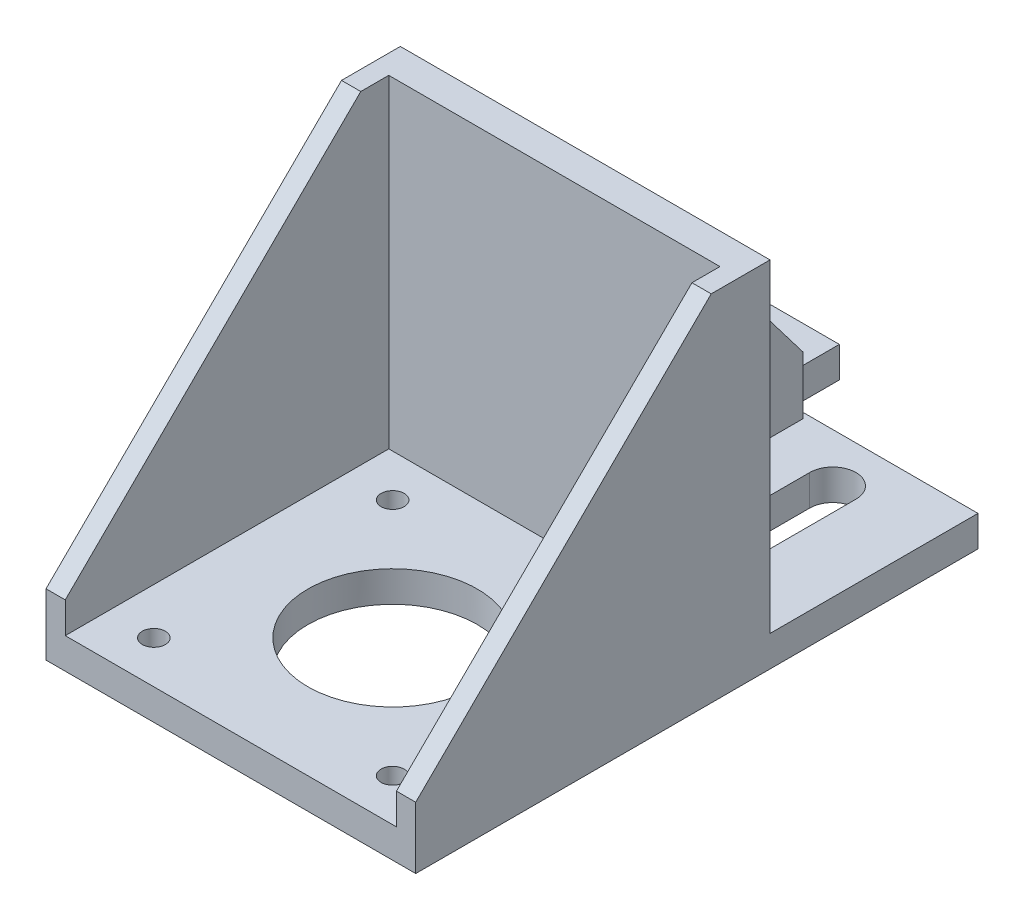
ISO-10303-21;
HEADER;
FILE_DESCRIPTION(('STEP AP214'),'2;1');
FILE_NAME('part.step','',(''),(''),'','','');
FILE_SCHEMA(('AUTOMOTIVE_DESIGN { 1 0 10303 214 1 1 1 1 }'));
ENDSEC;
DATA;
#1=APPLICATION_CONTEXT('core data for automotive mechanical design processes');
#2=APPLICATION_PROTOCOL_DEFINITION('international standard','automotive_design',2000,#1);
#3=PRODUCT_CONTEXT('',#1,'mechanical');
#4=PRODUCT('Part','Part','',(#3));
#5=PRODUCT_RELATED_PRODUCT_CATEGORY('part','',(#4));
#6=PRODUCT_DEFINITION_FORMATION('','',#4);
#7=PRODUCT_DEFINITION_CONTEXT('part definition',#1,'design');
#8=PRODUCT_DEFINITION('design','',#6,#7);
#9=PRODUCT_DEFINITION_SHAPE('','',#8);
#10=(LENGTH_UNIT() NAMED_UNIT(*) SI_UNIT(.MILLI.,.METRE.));
#11=(NAMED_UNIT(*) PLANE_ANGLE_UNIT() SI_UNIT($,.RADIAN.));
#12=(NAMED_UNIT(*) SI_UNIT($,.STERADIAN.) SOLID_ANGLE_UNIT());
#13=UNCERTAINTY_MEASURE_WITH_UNIT(LENGTH_MEASURE(1.E-05),#10,'distance_accuracy_value','');
#14=(GEOMETRIC_REPRESENTATION_CONTEXT(3) GLOBAL_UNCERTAINTY_ASSIGNED_CONTEXT((#13)) GLOBAL_UNIT_ASSIGNED_CONTEXT((#10,
#11,#12)) REPRESENTATION_CONTEXT('',''));
#15=CARTESIAN_POINT('',(0.,0.,0.));
#16=DIRECTION('',(0.,0.,1.));
#17=DIRECTION('',(1.,0.,0.));
#18=AXIS2_PLACEMENT_3D('',#15,#16,#17);
#19=CARTESIAN_POINT('',(-23.,24.7347576580942,-35.1537503302098));
#20=DIRECTION('',(0.,-0.606022226007594,0.795447711408362));
#21=DIRECTION('',(-1.,0.,0.));
#22=AXIS2_PLACEMENT_3D('',#19,#20,#21);
#23=PLANE('',#22);
#24=DIRECTION('',(0.,0.795447711408362,0.606022226007594));
#25=VECTOR('',#24,1.);
#26=CARTESIAN_POINT('',(-2.,35.6603818391844,-26.8299208794672));
#27=LINE('',#26,#25);
#28=CARTESIAN_POINT('',(-2.,7.46951531618834,-48.3075006604195));
#29=VERTEX_POINT('',#28);
#30=CARTESIAN_POINT('',(-2.,42.,-22.));
#31=VERTEX_POINT('',#30);
#32=EDGE_CURVE('E10',#29,#31,#27,.T.);
#33=ORIENTED_EDGE('',*,*,#32,.T.);
#34=DIRECTION('',(1.,0.,0.));
#35=VECTOR('',#34,1.);
#36=CARTESIAN_POINT('',(-23.,42.,-22.));
#37=LINE('',#36,#35);
#38=CARTESIAN_POINT('',(2.,42.,-22.));
#39=VERTEX_POINT('',#38);
#40=EDGE_CURVE('E292',#31,#39,#37,.T.);
#41=ORIENTED_EDGE('',*,*,#40,.T.);
#42=DIRECTION('',(0.,-0.795447711408362,-0.606022226007594));
#43=VECTOR('',#42,1.);
#44=CARTESIAN_POINT('',(2.,24.7347576580942,-35.1537503302098));
#45=LINE('',#44,#43);
#46=CARTESIAN_POINT('',(2.,7.46951531618833,-48.3075006604195));
#47=VERTEX_POINT('',#46);
#48=EDGE_CURVE('E308',#39,#47,#45,.T.);
#49=ORIENTED_EDGE('',*,*,#48,.T.);
#50=DIRECTION('',(1.,0.,0.));
#51=VECTOR('',#50,1.);
#52=CARTESIAN_POINT('',(-23.,7.46951531618833,-48.3075006604195));
#53=LINE('',#52,#51);
#54=EDGE_CURVE('E385',#29,#47,#53,.T.);
#55=ORIENTED_EDGE('',*,*,#54,.F.);
#56=EDGE_LOOP('',(#33,#41,#49,#55));
#57=FACE_BOUND('',#56,.T.);
#58=ADVANCED_FACE('F16',(#57),#23,.F.);
#59=CARTESIAN_POINT('',(-2.,42.002,-35.1537503302098));
#60=DIRECTION('',(-1.,0.,0.));
#61=DIRECTION('',(0.,1.,0.));
#62=AXIS2_PLACEMENT_3D('',#59,#60,#61);
#63=PLANE('',#62);
#64=ORIENTED_EDGE('',*,*,#32,.F.);
#65=DIRECTION('',(0.,-1.,0.));
#66=VECTOR('',#65,1.);
#67=CARTESIAN_POINT('',(-2.,42.002,-48.3075006604195));
#68=LINE('',#67,#66);
#69=CARTESIAN_POINT('',(-2.,0.,-48.3075006604195));
#70=VERTEX_POINT('',#69);
#71=EDGE_CURVE('E366',#29,#70,#68,.T.);
#72=ORIENTED_EDGE('',*,*,#71,.T.);
#73=DIRECTION('',(0.,0.,-1.));
#74=VECTOR('',#73,1.);
#75=CARTESIAN_POINT('',(-2.,0.,-35.1537503302098));
#76=LINE('',#75,#74);
#77=CARTESIAN_POINT('',(-2.,0.,-22.));
#78=VERTEX_POINT('',#77);
#79=EDGE_CURVE('E513',#78,#70,#76,.T.);
#80=ORIENTED_EDGE('',*,*,#79,.F.);
#81=DIRECTION('',(0.,-1.,0.));
#82=VECTOR('',#81,1.);
#83=CARTESIAN_POINT('',(-2.,42.002,-22.));
#84=LINE('',#83,#82);
#85=EDGE_CURVE('E371',#31,#78,#84,.T.);
#86=ORIENTED_EDGE('',*,*,#85,.F.);
#87=EDGE_LOOP('',(#64,#72,#80,#86));
#88=FACE_BOUND('',#87,.T.);
#89=ADVANCED_FACE('F656',(#88),#63,.T.);
#90=CARTESIAN_POINT('',(-14.,-25.,-54.));
#91=DIRECTION('',(0.,1.,0.));
#92=DIRECTION('',(0.,0.,1.));
#93=AXIS2_PLACEMENT_3D('',#90,#91,#92);
#94=CYLINDRICAL_SURFACE('',#93,3.);
#95=DIRECTION('',(0.,1.,0.));
#96=VECTOR('',#95,1.);
#97=CARTESIAN_POINT('',(-11.,-25.,-54.));
#98=LINE('',#97,#96);
#99=CARTESIAN_POINT('',(-11.,-4.,-54.));
#100=VERTEX_POINT('',#99);
#101=CARTESIAN_POINT('',(-11.,0.,-54.));
#102=VERTEX_POINT('',#101);
#103=EDGE_CURVE('E25',#100,#102,#98,.T.);
#104=ORIENTED_EDGE('',*,*,#103,.T.);
#105=CARTESIAN_POINT('',(-14.,0.,-54.));
#106=DIRECTION('',(0.,-1.,0.));
#107=DIRECTION('',(0.,0.,1.));
#108=AXIS2_PLACEMENT_3D('',#105,#106,#107);
#109=CIRCLE('',#108,3.);
#110=CARTESIAN_POINT('',(-17.,0.,-54.));
#111=VERTEX_POINT('',#110);
#112=EDGE_CURVE('E504',#111,#102,#109,.T.);
#113=ORIENTED_EDGE('',*,*,#112,.F.);
#114=DIRECTION('',(0.,1.,0.));
#115=VECTOR('',#114,1.);
#116=CARTESIAN_POINT('',(-17.,-25.,-54.));
#117=LINE('',#116,#115);
#118=CARTESIAN_POINT('',(-17.,-4.,-54.));
#119=VERTEX_POINT('',#118);
#120=EDGE_CURVE('E509',#119,#111,#117,.T.);
#121=ORIENTED_EDGE('',*,*,#120,.F.);
#122=CARTESIAN_POINT('',(-14.,-4.,-54.));
#123=DIRECTION('',(0.,1.,0.));
#124=DIRECTION('',(0.,0.,-1.));
#125=AXIS2_PLACEMENT_3D('',#122,#123,#124);
#126=CIRCLE('',#125,3.);
#127=EDGE_CURVE('E475',#100,#119,#126,.T.);
#128=ORIENTED_EDGE('',*,*,#127,.F.);
#129=EDGE_LOOP('',(#104,#113,#121,#128));
#130=FACE_BOUND('',#129,.T.);
#131=ADVANCED_FACE('F717',(#130),#94,.F.);
#132=CARTESIAN_POINT('',(-11.,-25.,-41.5));
#133=DIRECTION('',(1.,0.,0.));
#134=DIRECTION('',(0.,0.,-1.));
#135=AXIS2_PLACEMENT_3D('',#132,#133,#134);
#136=PLANE('',#135);
#137=DIRECTION('',(0.,0.,1.));
#138=VECTOR('',#137,1.);
#139=CARTESIAN_POINT('',(-11.,-4.,-17.5));
#140=LINE('',#139,#138);
#141=CARTESIAN_POINT('',(-11.,-4.,-29.));
#142=VERTEX_POINT('',#141);
#143=EDGE_CURVE('E422',#100,#142,#140,.T.);
#144=ORIENTED_EDGE('',*,*,#143,.T.);
#145=DIRECTION('',(0.,1.,0.));
#146=VECTOR('',#145,1.);
#147=CARTESIAN_POINT('',(-11.,-25.,-29.));
#148=LINE('',#147,#146);
#149=CARTESIAN_POINT('',(-11.,0.,-29.));
#150=VERTEX_POINT('',#149);
#151=EDGE_CURVE('E341',#142,#150,#148,.T.);
#152=ORIENTED_EDGE('',*,*,#151,.T.);
#153=DIRECTION('',(0.,0.,-1.));
#154=VECTOR('',#153,1.);
#155=CARTESIAN_POINT('',(-11.,0.,-41.5));
#156=LINE('',#155,#154);
#157=EDGE_CURVE('E508',#150,#102,#156,.T.);
#158=ORIENTED_EDGE('',*,*,#157,.T.);
#159=ORIENTED_EDGE('',*,*,#103,.F.);
#160=EDGE_LOOP('',(#144,#152,#158,#159));
#161=FACE_BOUND('',#160,.T.);
#162=ADVANCED_FACE('F728',(#161),#136,.F.);
#163=CARTESIAN_POINT('',(-14.,-25.,-29.));
#164=DIRECTION('',(0.,1.,0.));
#165=DIRECTION('',(0.,0.,1.));
#166=AXIS2_PLACEMENT_3D('',#163,#164,#165);
#167=CYLINDRICAL_SURFACE('',#166,3.);
#168=DIRECTION('',(0.,1.,0.));
#169=VECTOR('',#168,1.);
#170=CARTESIAN_POINT('',(-17.,-25.,-29.));
#171=LINE('',#170,#169);
#172=CARTESIAN_POINT('',(-17.,-4.,-29.));
#173=VERTEX_POINT('',#172);
#174=CARTESIAN_POINT('',(-17.,0.,-29.));
#175=VERTEX_POINT('',#174);
#176=EDGE_CURVE('E19',#173,#175,#171,.T.);
#177=ORIENTED_EDGE('',*,*,#176,.T.);
#178=CARTESIAN_POINT('',(-14.,0.,-29.));
#179=DIRECTION('',(0.,-1.,0.));
#180=DIRECTION('',(0.,0.,1.));
#181=AXIS2_PLACEMENT_3D('',#178,#179,#180);
#182=CIRCLE('',#181,3.);
#183=EDGE_CURVE('E519',#150,#175,#182,.T.);
#184=ORIENTED_EDGE('',*,*,#183,.F.);
#185=ORIENTED_EDGE('',*,*,#151,.F.);
#186=CARTESIAN_POINT('',(-14.,-4.,-29.));
#187=DIRECTION('',(0.,1.,0.));
#188=DIRECTION('',(0.,0.,-1.));
#189=AXIS2_PLACEMENT_3D('',#186,#187,#188);
#190=CIRCLE('',#189,3.);
#191=EDGE_CURVE('E418',#173,#142,#190,.T.);
#192=ORIENTED_EDGE('',*,*,#191,.F.);
#193=EDGE_LOOP('',(#177,#184,#185,#192));
#194=FACE_BOUND('',#193,.T.);
#195=ADVANCED_FACE('F725',(#194),#167,.F.);
#196=CARTESIAN_POINT('',(-17.,-25.,-41.5));
#197=DIRECTION('',(1.,0.,0.));
#198=DIRECTION('',(0.,1.,0.));
#199=AXIS2_PLACEMENT_3D('',#196,#197,#198);
#200=PLANE('',#199);
#201=ORIENTED_EDGE('',*,*,#120,.T.);
#202=DIRECTION('',(0.,0.,-1.));
#203=VECTOR('',#202,1.);
#204=CARTESIAN_POINT('',(-17.,0.,-41.5));
#205=LINE('',#204,#203);
#206=EDGE_CURVE('E301',#175,#111,#205,.T.);
#207=ORIENTED_EDGE('',*,*,#206,.F.);
#208=ORIENTED_EDGE('',*,*,#176,.F.);
#209=DIRECTION('',(0.,0.,1.));
#210=VECTOR('',#209,1.);
#211=CARTESIAN_POINT('',(-17.,-4.,-17.5));
#212=LINE('',#211,#210);
#213=EDGE_CURVE('E423',#119,#173,#212,.T.);
#214=ORIENTED_EDGE('',*,*,#213,.F.);
#215=EDGE_LOOP('',(#201,#207,#208,#214));
#216=FACE_BOUND('',#215,.T.);
#217=ADVANCED_FACE('F721',(#216),#200,.T.);
#218=CARTESIAN_POINT('',(11.4824352785945,-25.,-42.6700785756111));
#219=DIRECTION('',(0.,1.,0.));
#220=DIRECTION('',(0.,0.,1.));
#221=AXIS2_PLACEMENT_3D('',#218,#219,#220);
#222=CYLINDRICAL_SURFACE('',#221,3.);
#223=DIRECTION('',(0.,1.,0.));
#224=VECTOR('',#223,1.);
#225=CARTESIAN_POINT('',(14.4824352785945,-25.,-42.6700785756111));
#226=LINE('',#225,#224);
#227=CARTESIAN_POINT('',(14.4824352785945,-4.,-42.6700785756111));
#228=VERTEX_POINT('',#227);
#229=CARTESIAN_POINT('',(14.4824352785945,0.,-42.6700785756111));
#230=VERTEX_POINT('',#229);
#231=EDGE_CURVE('E512',#228,#230,#226,.T.);
#232=ORIENTED_EDGE('',*,*,#231,.T.);
#233=CARTESIAN_POINT('',(11.4824352785945,0.,-42.6700785756111));
#234=DIRECTION('',(0.,-1.,0.));
#235=DIRECTION('',(0.,0.,1.));
#236=AXIS2_PLACEMENT_3D('',#233,#234,#235);
#237=CIRCLE('',#236,3.);
#238=CARTESIAN_POINT('',(8.48243527859449,0.,-42.6700785756111));
#239=VERTEX_POINT('',#238);
#240=EDGE_CURVE('E527',#239,#230,#237,.T.);
#241=ORIENTED_EDGE('',*,*,#240,.F.);
#242=DIRECTION('',(0.,1.,0.));
#243=VECTOR('',#242,1.);
#244=CARTESIAN_POINT('',(8.48243527859449,-25.,-42.6700785756111));
#245=LINE('',#244,#243);
#246=CARTESIAN_POINT('',(8.48243527859449,-4.,-42.6700785756111));
#247=VERTEX_POINT('',#246);
#248=EDGE_CURVE('E538',#247,#239,#245,.T.);
#249=ORIENTED_EDGE('',*,*,#248,.F.);
#250=CARTESIAN_POINT('',(11.4824352785945,-4.,-42.6700785756111));
#251=DIRECTION('',(0.,1.,0.));
#252=DIRECTION('',(0.,0.,-1.));
#253=AXIS2_PLACEMENT_3D('',#250,#251,#252);
#254=CIRCLE('',#253,3.);
#255=EDGE_CURVE('E482',#228,#247,#254,.T.);
#256=ORIENTED_EDGE('',*,*,#255,.F.);
#257=EDGE_LOOP('',(#232,#241,#249,#256));
#258=FACE_BOUND('',#257,.T.);
#259=ADVANCED_FACE('F615',(#258),#222,.F.);
#260=CARTESIAN_POINT('',(14.4824352785945,-25.,-35.1700785756111));
#261=DIRECTION('',(1.,0.,0.));
#262=DIRECTION('',(0.,1.,0.));
#263=AXIS2_PLACEMENT_3D('',#260,#261,#262);
#264=PLANE('',#263);
#265=DIRECTION('',(0.,0.,1.));
#266=VECTOR('',#265,1.);
#267=CARTESIAN_POINT('',(14.4824352785945,-4.,-17.5));
#268=LINE('',#267,#266);
#269=CARTESIAN_POINT('',(14.4824352785945,-4.,-27.6700785756111));
#270=VERTEX_POINT('',#269);
#271=EDGE_CURVE('E352',#228,#270,#268,.T.);
#272=ORIENTED_EDGE('',*,*,#271,.T.);
#273=DIRECTION('',(0.,1.,0.));
#274=VECTOR('',#273,1.);
#275=CARTESIAN_POINT('',(14.4824352785945,-25.,-27.6700785756111));
#276=LINE('',#275,#274);
#277=CARTESIAN_POINT('',(14.4824352785945,0.,-27.6700785756111));
#278=VERTEX_POINT('',#277);
#279=EDGE_CURVE('E528',#270,#278,#276,.T.);
#280=ORIENTED_EDGE('',*,*,#279,.T.);
#281=DIRECTION('',(0.,0.,-1.));
#282=VECTOR('',#281,1.);
#283=CARTESIAN_POINT('',(14.4824352785945,0.,-35.1700785756111));
#284=LINE('',#283,#282);
#285=EDGE_CURVE('E535',#278,#230,#284,.T.);
#286=ORIENTED_EDGE('',*,*,#285,.T.);
#287=ORIENTED_EDGE('',*,*,#231,.F.);
#288=EDGE_LOOP('',(#272,#280,#286,#287));
#289=FACE_BOUND('',#288,.T.);
#290=ADVANCED_FACE('F754',(#289),#264,.F.);
#291=CARTESIAN_POINT('',(11.4824352785945,-25.,-27.6700785756111));
#292=DIRECTION('',(0.,1.,0.));
#293=DIRECTION('',(0.,0.,1.));
#294=AXIS2_PLACEMENT_3D('',#291,#292,#293);
#295=CYLINDRICAL_SURFACE('',#294,3.);
#296=DIRECTION('',(0.,1.,0.));
#297=VECTOR('',#296,1.);
#298=CARTESIAN_POINT('',(8.4824352785945,-25.,-27.6700785756111));
#299=LINE('',#298,#297);
#300=CARTESIAN_POINT('',(8.4824352785945,-4.,-27.6700785756111));
#301=VERTEX_POINT('',#300);
#302=CARTESIAN_POINT('',(8.4824352785945,0.,-27.6700785756111));
#303=VERTEX_POINT('',#302);
#304=EDGE_CURVE('E531',#301,#303,#299,.T.);
#305=ORIENTED_EDGE('',*,*,#304,.T.);
#306=CARTESIAN_POINT('',(11.4824352785945,0.,-27.6700785756111));
#307=DIRECTION('',(0.,-1.,0.));
#308=DIRECTION('',(0.,0.,1.));
#309=AXIS2_PLACEMENT_3D('',#306,#307,#308);
#310=CIRCLE('',#309,3.);
#311=EDGE_CURVE('E334',#278,#303,#310,.T.);
#312=ORIENTED_EDGE('',*,*,#311,.F.);
#313=ORIENTED_EDGE('',*,*,#279,.F.);
#314=CARTESIAN_POINT('',(11.4824352785945,-4.,-27.6700785756111));
#315=DIRECTION('',(0.,1.,0.));
#316=DIRECTION('',(0.,0.,-1.));
#317=AXIS2_PLACEMENT_3D('',#314,#315,#316);
#318=CIRCLE('',#317,3.);
#319=EDGE_CURVE('E545',#301,#270,#318,.T.);
#320=ORIENTED_EDGE('',*,*,#319,.F.);
#321=EDGE_LOOP('',(#305,#312,#313,#320));
#322=FACE_BOUND('',#321,.T.);
#323=ADVANCED_FACE('F755',(#322),#295,.F.);
#324=CARTESIAN_POINT('',(8.48243527859449,-25.,-35.1700785756111));
#325=DIRECTION('',(1.,0.,0.));
#326=DIRECTION('',(0.,1.,0.));
#327=AXIS2_PLACEMENT_3D('',#324,#325,#326);
#328=PLANE('',#327);
#329=ORIENTED_EDGE('',*,*,#248,.T.);
#330=DIRECTION('',(0.,0.,-1.));
#331=VECTOR('',#330,1.);
#332=CARTESIAN_POINT('',(8.48243527859449,0.,-35.1700785756111));
#333=LINE('',#332,#331);
#334=EDGE_CURVE('E523',#303,#239,#333,.T.);
#335=ORIENTED_EDGE('',*,*,#334,.F.);
#336=ORIENTED_EDGE('',*,*,#304,.F.);
#337=DIRECTION('',(0.,0.,1.));
#338=VECTOR('',#337,1.);
#339=CARTESIAN_POINT('',(8.48243527859449,-4.,-17.5));
#340=LINE('',#339,#338);
#341=EDGE_CURVE('E566',#247,#301,#340,.T.);
#342=ORIENTED_EDGE('',*,*,#341,.F.);
#343=EDGE_LOOP('',(#329,#335,#336,#342));
#344=FACE_BOUND('',#343,.T.);
#345=ADVANCED_FACE('F612',(#344),#328,.T.);
#346=CARTESIAN_POINT('',(-86.6,23.0110234618187,4.81777348369362));
#347=DIRECTION('',(0.,-0.710677554664259,-0.703517884134035));
#348=DIRECTION('',(0.,0.703517884134035,-0.710677554664259));
#349=AXIS2_PLACEMENT_3D('',#346,#347,#348);
#350=PLANE('',#349);
#351=DIRECTION('',(0.,-0.703517884134035,0.710677554664259));
#352=VECTOR('',#351,1.);
#353=CARTESIAN_POINT('',(-24.,12.0510206393245,15.8893157723322));
#354=LINE('',#353,#352);
#355=CARTESIAN_POINT('',(-24.,42.,-14.3644530326128));
#356=VERTEX_POINT('',#355);
#357=CARTESIAN_POINT('',(-24.,4.02204692363739,24.));
#358=VERTEX_POINT('',#357);
#359=EDGE_CURVE('E554',#356,#358,#354,.T.);
#360=ORIENTED_EDGE('',*,*,#359,.T.);
#361=DIRECTION('',(1.,0.,0.));
#362=VECTOR('',#361,1.);
#363=CARTESIAN_POINT('',(-86.6,4.02204692363739,24.));
#364=LINE('',#363,#362);
#365=CARTESIAN_POINT('',(-21.5,4.02204692363741,24.));
#366=VERTEX_POINT('',#365);
#367=EDGE_CURVE('E359',#358,#366,#364,.T.);
#368=ORIENTED_EDGE('',*,*,#367,.T.);
#369=DIRECTION('',(0.,-0.703517884134035,0.710677554664259));
#370=VECTOR('',#369,1.);
#371=CARTESIAN_POINT('',(-21.5,33.3182185422835,-5.59431746726872));
#372=LINE('',#371,#370);
#373=CARTESIAN_POINT('',(-21.5,42.,-14.3644530326128));
#374=VERTEX_POINT('',#373);
#375=EDGE_CURVE('E410',#374,#366,#372,.T.);
#376=ORIENTED_EDGE('',*,*,#375,.F.);
#377=DIRECTION('',(1.,0.,0.));
#378=VECTOR('',#377,1.);
#379=CARTESIAN_POINT('',(-86.6,42.,-14.3644530326128));
#380=LINE('',#379,#378);
#381=EDGE_CURVE('E449',#356,#374,#380,.T.);
#382=ORIENTED_EDGE('',*,*,#381,.F.);
#383=EDGE_LOOP('',(#360,#368,#376,#382));
#384=FACE_BOUND('',#383,.T.);
#385=ADVANCED_FACE('F672',(#384),#350,.F.);
#386=CARTESIAN_POINT('',(-86.6,23.0110234618187,4.81777348369362));
#387=DIRECTION('',(0.,-0.710677554664259,-0.703517884134035));
#388=DIRECTION('',(0.,0.703517884134035,-0.710677554664259));
#389=AXIS2_PLACEMENT_3D('',#386,#387,#388);
#390=PLANE('',#389);
#391=DIRECTION('',(0.,-0.703517884134035,0.710677554664259));
#392=VECTOR('',#391,1.);
#393=CARTESIAN_POINT('',(21.5,33.3182185422835,-5.59431746726872));
#394=LINE('',#393,#392);
#395=CARTESIAN_POINT('',(21.5,42.,-14.3644530326128));
#396=VERTEX_POINT('',#395);
#397=CARTESIAN_POINT('',(21.5,4.02204692363739,24.));
#398=VERTEX_POINT('',#397);
#399=EDGE_CURVE('E601',#396,#398,#394,.T.);
#400=ORIENTED_EDGE('',*,*,#399,.T.);
#401=DIRECTION('',(1.,0.,0.));
#402=VECTOR('',#401,1.);
#403=CARTESIAN_POINT('',(-86.6,4.02204692363739,24.));
#404=LINE('',#403,#402);
#405=CARTESIAN_POINT('',(24.,4.02204692363739,24.));
#406=VERTEX_POINT('',#405);
#407=EDGE_CURVE('E461',#398,#406,#404,.T.);
#408=ORIENTED_EDGE('',*,*,#407,.T.);
#409=DIRECTION('',(0.,0.703517884134035,-0.710677554664259));
#410=VECTOR('',#409,1.);
#411=CARTESIAN_POINT('',(24.,23.0110234618187,4.81777348369361));
#412=LINE('',#411,#410);
#413=CARTESIAN_POINT('',(24.,42.,-14.3644530326128));
#414=VERTEX_POINT('',#413);
#415=EDGE_CURVE('E340',#406,#414,#412,.T.);
#416=ORIENTED_EDGE('',*,*,#415,.T.);
#417=DIRECTION('',(1.,0.,0.));
#418=VECTOR('',#417,1.);
#419=CARTESIAN_POINT('',(-86.6,42.,-14.3644530326128));
#420=LINE('',#419,#418);
#421=EDGE_CURVE('E302',#396,#414,#420,.T.);
#422=ORIENTED_EDGE('',*,*,#421,.F.);
#423=EDGE_LOOP('',(#400,#408,#416,#422));
#424=FACE_BOUND('',#423,.T.);
#425=ADVANCED_FACE('F683',(#424),#390,.F.);
#426=CARTESIAN_POINT('',(15.5,-25.,18.5));
#427=DIRECTION('',(0.,1.,0.));
#428=DIRECTION('',(0.,0.,1.));
#429=AXIS2_PLACEMENT_3D('',#426,#427,#428);
#430=CYLINDRICAL_SURFACE('',#429,1.5);
#431=CARTESIAN_POINT('',(15.5,0.,18.5));
#432=DIRECTION('',(0.,1.,0.));
#433=DIRECTION('',(0.,0.,1.));
#434=AXIS2_PLACEMENT_3D('',#431,#432,#433);
#435=CIRCLE('',#434,1.5);
#436=CARTESIAN_POINT('',(15.5,0.,20.));
#437=VERTEX_POINT('',#436);
#438=EDGE_CURVE('E588',#437,#437,#435,.T.);
#439=ORIENTED_EDGE('',*,*,#438,.T.);
#440=EDGE_LOOP('',(#439));
#441=FACE_BOUND('',#440,.T.);
#442=CARTESIAN_POINT('',(15.5,-4.,18.5));
#443=DIRECTION('',(0.,-1.,0.));
#444=DIRECTION('',(0.,0.,-1.));
#445=AXIS2_PLACEMENT_3D('',#442,#443,#444);
#446=CIRCLE('',#445,1.5);
#447=CARTESIAN_POINT('',(15.5,-4.,17.));
#448=VERTEX_POINT('',#447);
#449=EDGE_CURVE('E348',#448,#448,#446,.T.);
#450=ORIENTED_EDGE('',*,*,#449,.T.);
#451=EDGE_LOOP('',(#450));
#452=FACE_BOUND('',#451,.T.);
#453=ADVANCED_FACE('F701',(#441,#452),#430,.F.);
#454=CARTESIAN_POINT('',(15.5,-25.,-12.5));
#455=DIRECTION('',(0.,1.,0.));
#456=DIRECTION('',(0.,0.,1.));
#457=AXIS2_PLACEMENT_3D('',#454,#455,#456);
#458=CYLINDRICAL_SURFACE('',#457,1.5);
#459=CARTESIAN_POINT('',(15.5,0.,-12.5));
#460=DIRECTION('',(0.,1.,0.));
#461=DIRECTION('',(0.,0.,1.));
#462=AXIS2_PLACEMENT_3D('',#459,#460,#461);
#463=CIRCLE('',#462,1.5);
#464=CARTESIAN_POINT('',(15.5,0.,-11.));
#465=VERTEX_POINT('',#464);
#466=EDGE_CURVE('E381',#465,#465,#463,.T.);
#467=ORIENTED_EDGE('',*,*,#466,.T.);
#468=EDGE_LOOP('',(#467));
#469=FACE_BOUND('',#468,.T.);
#470=CARTESIAN_POINT('',(15.5,-4.,-12.5));
#471=DIRECTION('',(0.,-1.,0.));
#472=DIRECTION('',(0.,0.,-1.));
#473=AXIS2_PLACEMENT_3D('',#470,#471,#472);
#474=CIRCLE('',#473,1.5);
#475=CARTESIAN_POINT('',(15.5,-4.,-14.));
#476=VERTEX_POINT('',#475);
#477=EDGE_CURVE('E351',#476,#476,#474,.T.);
#478=ORIENTED_EDGE('',*,*,#477,.T.);
#479=EDGE_LOOP('',(#478));
#480=FACE_BOUND('',#479,.T.);
#481=ADVANCED_FACE('F704',(#469,#480),#458,.F.);
#482=CARTESIAN_POINT('',(-15.5,-25.,-12.5));
#483=DIRECTION('',(0.,1.,0.));
#484=DIRECTION('',(0.,0.,1.));
#485=AXIS2_PLACEMENT_3D('',#482,#483,#484);
#486=CYLINDRICAL_SURFACE('',#485,1.5);
#487=CARTESIAN_POINT('',(-15.5,0.,-12.5));
#488=DIRECTION('',(0.,1.,0.));
#489=DIRECTION('',(0.,0.,1.));
#490=AXIS2_PLACEMENT_3D('',#487,#488,#489);
#491=CIRCLE('',#490,1.5);
#492=CARTESIAN_POINT('',(-15.5,0.,-11.));
#493=VERTEX_POINT('',#492);
#494=EDGE_CURVE('E377',#493,#493,#491,.T.);
#495=ORIENTED_EDGE('',*,*,#494,.T.);
#496=EDGE_LOOP('',(#495));
#497=FACE_BOUND('',#496,.T.);
#498=CARTESIAN_POINT('',(-15.5,-4.,-12.5));
#499=DIRECTION('',(0.,-1.,0.));
#500=DIRECTION('',(0.,0.,-1.));
#501=AXIS2_PLACEMENT_3D('',#498,#499,#500);
#502=CIRCLE('',#501,1.5);
#503=CARTESIAN_POINT('',(-15.5,-4.,-14.));
#504=VERTEX_POINT('',#503);
#505=EDGE_CURVE('E486',#504,#504,#502,.T.);
#506=ORIENTED_EDGE('',*,*,#505,.T.);
#507=EDGE_LOOP('',(#506));
#508=FACE_BOUND('',#507,.T.);
#509=ADVANCED_FACE('F766',(#497,#508),#486,.F.);
#510=CARTESIAN_POINT('',(0.,-25.,3.));
#511=DIRECTION('',(0.,1.,0.));
#512=DIRECTION('',(0.,0.,1.));
#513=AXIS2_PLACEMENT_3D('',#510,#511,#512);
#514=CYLINDRICAL_SURFACE('',#513,11.);
#515=CARTESIAN_POINT('',(0.,0.,3.));
#516=DIRECTION('',(0.,1.,0.));
#517=DIRECTION('',(0.,0.,1.));
#518=AXIS2_PLACEMENT_3D('',#515,#516,#517);
#519=CIRCLE('',#518,11.);
#520=CARTESIAN_POINT('',(0.,0.,14.));
#521=VERTEX_POINT('',#520);
#522=EDGE_CURVE('E380',#521,#521,#519,.T.);
#523=ORIENTED_EDGE('',*,*,#522,.T.);
#524=EDGE_LOOP('',(#523));
#525=FACE_BOUND('',#524,.T.);
#526=CARTESIAN_POINT('',(0.,-4.,3.));
#527=DIRECTION('',(0.,-1.,0.));
#528=DIRECTION('',(0.,0.,-1.));
#529=AXIS2_PLACEMENT_3D('',#526,#527,#528);
#530=CIRCLE('',#529,11.);
#531=CARTESIAN_POINT('',(0.,-4.,-8.));
#532=VERTEX_POINT('',#531);
#533=EDGE_CURVE('E489',#532,#532,#530,.T.);
#534=ORIENTED_EDGE('',*,*,#533,.T.);
#535=EDGE_LOOP('',(#534));
#536=FACE_BOUND('',#535,.T.);
#537=ADVANCED_FACE('F770',(#525,#536),#514,.F.);
#538=CARTESIAN_POINT('',(-15.5,-25.,18.5));
#539=DIRECTION('',(0.,1.,0.));
#540=DIRECTION('',(0.,0.,1.));
#541=AXIS2_PLACEMENT_3D('',#538,#539,#540);
#542=CYLINDRICAL_SURFACE('',#541,1.5);
#543=CARTESIAN_POINT('',(-15.5,0.,18.5));
#544=DIRECTION('',(0.,1.,0.));
#545=DIRECTION('',(0.,0.,1.));
#546=AXIS2_PLACEMENT_3D('',#543,#544,#545);
#547=CIRCLE('',#546,1.5);
#548=CARTESIAN_POINT('',(-15.5,0.,20.));
#549=VERTEX_POINT('',#548);
#550=EDGE_CURVE('E442',#549,#549,#547,.T.);
#551=ORIENTED_EDGE('',*,*,#550,.T.);
#552=EDGE_LOOP('',(#551));
#553=FACE_BOUND('',#552,.T.);
#554=CARTESIAN_POINT('',(-15.5,-4.,18.5));
#555=DIRECTION('',(0.,-1.,0.));
#556=DIRECTION('',(0.,0.,-1.));
#557=AXIS2_PLACEMENT_3D('',#554,#555,#556);
#558=CIRCLE('',#557,1.5);
#559=CARTESIAN_POINT('',(-15.5,-4.,17.));
#560=VERTEX_POINT('',#559);
#561=EDGE_CURVE('E585',#560,#560,#558,.T.);
#562=ORIENTED_EDGE('',*,*,#561,.T.);
#563=EDGE_LOOP('',(#562));
#564=FACE_BOUND('',#563,.T.);
#565=ADVANCED_FACE('F774',(#553,#564),#542,.F.);
#566=CARTESIAN_POINT('',(21.5,42.,3.));
#567=DIRECTION('',(-1.,0.,0.));
#568=DIRECTION('',(0.,0.,1.));
#569=AXIS2_PLACEMENT_3D('',#566,#567,#568);
#570=PLANE('',#569);
#571=ORIENTED_EDGE('',*,*,#399,.F.);
#572=DIRECTION('',(0.,0.,-1.));
#573=VECTOR('',#572,1.);
#574=CARTESIAN_POINT('',(21.5,42.,3.));
#575=LINE('',#574,#573);
#576=CARTESIAN_POINT('',(21.5,42.,-18.));
#577=VERTEX_POINT('',#576);
#578=EDGE_CURVE('E353',#396,#577,#575,.T.);
#579=ORIENTED_EDGE('',*,*,#578,.T.);
#580=DIRECTION('',(0.,-1.,0.));
#581=VECTOR('',#580,1.);
#582=CARTESIAN_POINT('',(21.5,42.,-18.));
#583=LINE('',#582,#581);
#584=CARTESIAN_POINT('',(21.5,0.,-18.));
#585=VERTEX_POINT('',#584);
#586=EDGE_CURVE('E48',#577,#585,#583,.T.);
#587=ORIENTED_EDGE('',*,*,#586,.T.);
#588=DIRECTION('',(0.,0.,-1.));
#589=VECTOR('',#588,1.);
#590=CARTESIAN_POINT('',(21.5,0.,3.));
#591=LINE('',#590,#589);
#592=CARTESIAN_POINT('',(21.5,0.,24.));
#593=VERTEX_POINT('',#592);
#594=EDGE_CURVE('E404',#593,#585,#591,.T.);
#595=ORIENTED_EDGE('',*,*,#594,.F.);
#596=DIRECTION('',(0.,-1.,0.));
#597=VECTOR('',#596,1.);
#598=CARTESIAN_POINT('',(21.5,42.,24.));
#599=LINE('',#598,#597);
#600=EDGE_CURVE('E464',#398,#593,#599,.T.);
#601=ORIENTED_EDGE('',*,*,#600,.F.);
#602=EDGE_LOOP('',(#571,#579,#587,#595,#601));
#603=FACE_BOUND('',#602,.T.);
#604=ADVANCED_FACE('F679',(#603),#570,.T.);
#605=CARTESIAN_POINT('',(0.,42.,-18.));
#606=DIRECTION('',(0.,0.,-1.));
#607=DIRECTION('',(0.,-1.,0.));
#608=AXIS2_PLACEMENT_3D('',#605,#606,#607);
#609=PLANE('',#608);
#610=DIRECTION('',(1.,0.,0.));
#611=VECTOR('',#610,1.);
#612=CARTESIAN_POINT('',(0.,0.,-18.));
#613=LINE('',#612,#611);
#614=CARTESIAN_POINT('',(-21.5,0.,-18.));
#615=VERTEX_POINT('',#614);
#616=EDGE_CURVE('E400',#615,#585,#613,.T.);
#617=ORIENTED_EDGE('',*,*,#616,.T.);
#618=ORIENTED_EDGE('',*,*,#586,.F.);
#619=DIRECTION('',(1.,0.,0.));
#620=VECTOR('',#619,1.);
#621=CARTESIAN_POINT('',(0.,42.,-18.));
#622=LINE('',#621,#620);
#623=CARTESIAN_POINT('',(-21.5,42.,-18.));
#624=VERTEX_POINT('',#623);
#625=EDGE_CURVE('E356',#624,#577,#622,.T.);
#626=ORIENTED_EDGE('',*,*,#625,.F.);
#627=DIRECTION('',(0.,-1.,0.));
#628=VECTOR('',#627,1.);
#629=CARTESIAN_POINT('',(-21.5,42.,-18.));
#630=LINE('',#629,#628);
#631=EDGE_CURVE('E38',#624,#615,#630,.T.);
#632=ORIENTED_EDGE('',*,*,#631,.T.);
#633=EDGE_LOOP('',(#617,#618,#626,#632));
#634=FACE_BOUND('',#633,.T.);
#635=ADVANCED_FACE('F678',(#634),#609,.F.);
#636=CARTESIAN_POINT('',(-21.5,42.,3.));
#637=DIRECTION('',(-1.,0.,0.));
#638=DIRECTION('',(0.,0.,1.));
#639=AXIS2_PLACEMENT_3D('',#636,#637,#638);
#640=PLANE('',#639);
#641=DIRECTION('',(0.,0.,-1.));
#642=VECTOR('',#641,1.);
#643=CARTESIAN_POINT('',(-21.5,42.,3.));
#644=LINE('',#643,#642);
#645=EDGE_CURVE('E445',#374,#624,#644,.T.);
#646=ORIENTED_EDGE('',*,*,#645,.F.);
#647=ORIENTED_EDGE('',*,*,#375,.T.);
#648=DIRECTION('',(0.,-1.,0.));
#649=VECTOR('',#648,1.);
#650=CARTESIAN_POINT('',(-21.5,42.,24.));
#651=LINE('',#650,#649);
#652=CARTESIAN_POINT('',(-21.5,0.,24.));
#653=VERTEX_POINT('',#652);
#654=EDGE_CURVE('E311',#366,#653,#651,.T.);
#655=ORIENTED_EDGE('',*,*,#654,.T.);
#656=DIRECTION('',(0.,0.,-1.));
#657=VECTOR('',#656,1.);
#658=CARTESIAN_POINT('',(-21.5,0.,3.));
#659=LINE('',#658,#657);
#660=EDGE_CURVE('E403',#653,#615,#659,.T.);
#661=ORIENTED_EDGE('',*,*,#660,.T.);
#662=ORIENTED_EDGE('',*,*,#631,.F.);
#663=EDGE_LOOP('',(#646,#647,#655,#661,#662));
#664=FACE_BOUND('',#663,.T.);
#665=ADVANCED_FACE('F676',(#664),#640,.F.);
#666=CARTESIAN_POINT('',(0.,42.,-22.));
#667=DIRECTION('',(0.,0.,-1.));
#668=DIRECTION('',(0.,-1.,0.));
#669=AXIS2_PLACEMENT_3D('',#666,#667,#668);
#670=PLANE('',#669);
#671=DIRECTION('',(0.,-1.,0.));
#672=VECTOR('',#671,1.);
#673=CARTESIAN_POINT('',(2.,42.002,-22.));
#674=LINE('',#673,#672);
#675=CARTESIAN_POINT('',(2.,0.,-22.));
#676=VERTEX_POINT('',#675);
#677=EDGE_CURVE('E314',#39,#676,#674,.T.);
#678=ORIENTED_EDGE('',*,*,#677,.F.);
#679=DIRECTION('',(1.,0.,0.));
#680=VECTOR('',#679,1.);
#681=CARTESIAN_POINT('',(0.,42.,-22.));
#682=LINE('',#681,#680);
#683=CARTESIAN_POINT('',(24.,42.,-22.));
#684=VERTEX_POINT('',#683);
#685=EDGE_CURVE('E288',#39,#684,#682,.T.);
#686=ORIENTED_EDGE('',*,*,#685,.T.);
#687=DIRECTION('',(0.,-1.,0.));
#688=VECTOR('',#687,1.);
#689=CARTESIAN_POINT('',(24.,42.,-22.));
#690=LINE('',#689,#688);
#691=CARTESIAN_POINT('',(24.,0.,-22.));
#692=VERTEX_POINT('',#691);
#693=EDGE_CURVE('E438',#684,#692,#690,.T.);
#694=ORIENTED_EDGE('',*,*,#693,.T.);
#695=DIRECTION('',(1.,0.,0.));
#696=VECTOR('',#695,1.);
#697=CARTESIAN_POINT('',(0.,0.,-22.));
#698=LINE('',#697,#696);
#699=EDGE_CURVE('E316',#676,#692,#698,.T.);
#700=ORIENTED_EDGE('',*,*,#699,.F.);
#701=EDGE_LOOP('',(#678,#686,#694,#700));
#702=FACE_BOUND('',#701,.T.);
#703=ADVANCED_FACE('F315',(#702),#670,.T.);
#704=CARTESIAN_POINT('',(0.,0.,-17.5));
#705=DIRECTION('',(0.,-1.,0.));
#706=DIRECTION('',(0.,0.,-1.));
#707=AXIS2_PLACEMENT_3D('',#704,#705,#706);
#708=PLANE('',#707);
#709=DIRECTION('',(-1.,0.,0.));
#710=VECTOR('',#709,1.);
#711=CARTESIAN_POINT('',(0.,0.,24.));
#712=LINE('',#711,#710);
#713=EDGE_CURVE('E468',#593,#653,#712,.T.);
#714=ORIENTED_EDGE('',*,*,#713,.F.);
#715=ORIENTED_EDGE('',*,*,#594,.T.);
#716=ORIENTED_EDGE('',*,*,#616,.F.);
#717=ORIENTED_EDGE('',*,*,#660,.F.);
#718=EDGE_LOOP('',(#714,#715,#716,#717));
#719=FACE_BOUND('',#718,.T.);
#720=ORIENTED_EDGE('',*,*,#550,.F.);
#721=EDGE_LOOP('',(#720));
#722=FACE_BOUND('',#721,.T.);
#723=ORIENTED_EDGE('',*,*,#522,.F.);
#724=EDGE_LOOP('',(#723));
#725=FACE_BOUND('',#724,.T.);
#726=ORIENTED_EDGE('',*,*,#494,.F.);
#727=EDGE_LOOP('',(#726));
#728=FACE_BOUND('',#727,.T.);
#729=ORIENTED_EDGE('',*,*,#466,.F.);
#730=EDGE_LOOP('',(#729));
#731=FACE_BOUND('',#730,.T.);
#732=ORIENTED_EDGE('',*,*,#438,.F.);
#733=EDGE_LOOP('',(#732));
#734=FACE_BOUND('',#733,.T.);
#735=ADVANCED_FACE('F687',(#719,#722,#725,#728,#731,#734),#708,.F.);
#736=CARTESIAN_POINT('',(0.,-4.,-17.5));
#737=DIRECTION('',(0.,-1.,0.));
#738=DIRECTION('',(0.,0.,-1.));
#739=AXIS2_PLACEMENT_3D('',#736,#737,#738);
#740=PLANE('',#739);
#741=DIRECTION('',(0.,0.,1.));
#742=VECTOR('',#741,1.);
#743=CARTESIAN_POINT('',(-24.,-4.,0.));
#744=LINE('',#743,#742);
#745=CARTESIAN_POINT('',(-24.,-4.,-59.));
#746=VERTEX_POINT('',#745);
#747=CARTESIAN_POINT('',(-24.,-4.,24.));
#748=VERTEX_POINT('',#747);
#749=EDGE_CURVE('E560',#746,#748,#744,.T.);
#750=ORIENTED_EDGE('',*,*,#749,.F.);
#751=DIRECTION('',(1.,0.,0.));
#752=VECTOR('',#751,1.);
#753=CARTESIAN_POINT('',(-14.,-4.,-59.));
#754=LINE('',#753,#752);
#755=CARTESIAN_POINT('',(-4.,-4.,-59.));
#756=VERTEX_POINT('',#755);
#757=EDGE_CURVE('E430',#746,#756,#754,.T.);
#758=ORIENTED_EDGE('',*,*,#757,.T.);
#759=DIRECTION('',(0.,0.,1.));
#760=VECTOR('',#759,1.);
#761=CARTESIAN_POINT('',(-4.,-4.,-54.));
#762=LINE('',#761,#760);
#763=CARTESIAN_POINT('',(-4.,-4.,-49.));
#764=VERTEX_POINT('',#763);
#765=EDGE_CURVE('E424',#756,#764,#762,.T.);
#766=ORIENTED_EDGE('',*,*,#765,.T.);
#767=DIRECTION('',(-1.,0.,0.));
#768=VECTOR('',#767,1.);
#769=CARTESIAN_POINT('',(10.,-4.,-49.));
#770=LINE('',#769,#768);
#771=CARTESIAN_POINT('',(24.,-4.,-49.));
#772=VERTEX_POINT('',#771);
#773=EDGE_CURVE('E428',#772,#764,#770,.T.);
#774=ORIENTED_EDGE('',*,*,#773,.F.);
#775=DIRECTION('',(0.,0.,1.));
#776=VECTOR('',#775,1.);
#777=CARTESIAN_POINT('',(24.,-4.,0.));
#778=LINE('',#777,#776);
#779=CARTESIAN_POINT('',(24.,-4.,24.));
#780=VERTEX_POINT('',#779);
#781=EDGE_CURVE('E339',#772,#780,#778,.T.);
#782=ORIENTED_EDGE('',*,*,#781,.T.);
#783=DIRECTION('',(-1.,0.,0.));
#784=VECTOR('',#783,1.);
#785=CARTESIAN_POINT('',(0.,-4.,24.));
#786=LINE('',#785,#784);
#787=EDGE_CURVE('E457',#780,#748,#786,.T.);
#788=ORIENTED_EDGE('',*,*,#787,.T.);
#789=EDGE_LOOP('',(#750,#758,#766,#774,#782,#788));
#790=FACE_BOUND('',#789,.T.);
#791=ORIENTED_EDGE('',*,*,#561,.F.);
#792=EDGE_LOOP('',(#791));
#793=FACE_BOUND('',#792,.T.);
#794=ORIENTED_EDGE('',*,*,#533,.F.);
#795=EDGE_LOOP('',(#794));
#796=FACE_BOUND('',#795,.T.);
#797=ORIENTED_EDGE('',*,*,#505,.F.);
#798=EDGE_LOOP('',(#797));
#799=FACE_BOUND('',#798,.T.);
#800=ORIENTED_EDGE('',*,*,#477,.F.);
#801=EDGE_LOOP('',(#800));
#802=FACE_BOUND('',#801,.T.);
#803=ORIENTED_EDGE('',*,*,#449,.F.);
#804=EDGE_LOOP('',(#803));
#805=FACE_BOUND('',#804,.T.);
#806=ORIENTED_EDGE('',*,*,#255,.T.);
#807=ORIENTED_EDGE('',*,*,#341,.T.);
#808=ORIENTED_EDGE('',*,*,#319,.T.);
#809=ORIENTED_EDGE('',*,*,#271,.F.);
#810=EDGE_LOOP('',(#806,#807,#808,#809));
#811=FACE_BOUND('',#810,.T.);
#812=ORIENTED_EDGE('',*,*,#127,.T.);
#813=ORIENTED_EDGE('',*,*,#213,.T.);
#814=ORIENTED_EDGE('',*,*,#191,.T.);
#815=ORIENTED_EDGE('',*,*,#143,.F.);
#816=EDGE_LOOP('',(#812,#813,#814,#815));
#817=FACE_BOUND('',#816,.T.);
#818=ADVANCED_FACE('F643',(#790,#793,#796,#799,#802,#805,#811,#817),#740,.T.);
#819=CARTESIAN_POINT('',(10.,-4.,-49.));
#820=DIRECTION('',(0.,0.,-1.));
#821=DIRECTION('',(0.,-1.,0.));
#822=AXIS2_PLACEMENT_3D('',#819,#820,#821);
#823=PLANE('',#822);
#824=DIRECTION('',(-1.,0.,0.));
#825=VECTOR('',#824,1.);
#826=CARTESIAN_POINT('',(10.,0.,-49.));
#827=LINE('',#826,#825);
#828=CARTESIAN_POINT('',(24.,0.,-49.));
#829=VERTEX_POINT('',#828);
#830=CARTESIAN_POINT('',(-4.,0.,-49.));
#831=VERTEX_POINT('',#830);
#832=EDGE_CURVE('E546',#829,#831,#827,.T.);
#833=ORIENTED_EDGE('',*,*,#832,.F.);
#834=DIRECTION('',(0.,1.,0.));
#835=VECTOR('',#834,1.);
#836=CARTESIAN_POINT('',(24.,-4.,-49.));
#837=LINE('',#836,#835);
#838=EDGE_CURVE('E370',#772,#829,#837,.T.);
#839=ORIENTED_EDGE('',*,*,#838,.F.);
#840=ORIENTED_EDGE('',*,*,#773,.T.);
#841=DIRECTION('',(0.,1.,0.));
#842=VECTOR('',#841,1.);
#843=CARTESIAN_POINT('',(-4.,-4.,-49.));
#844=LINE('',#843,#842);
#845=EDGE_CURVE('E429',#764,#831,#844,.T.);
#846=ORIENTED_EDGE('',*,*,#845,.T.);
#847=EDGE_LOOP('',(#833,#839,#840,#846));
#848=FACE_BOUND('',#847,.T.);
#849=ADVANCED_FACE('F639',(#848),#823,.T.);
#850=CARTESIAN_POINT('',(-4.,-4.,-54.));
#851=DIRECTION('',(-1.,0.,0.));
#852=DIRECTION('',(0.,0.,1.));
#853=AXIS2_PLACEMENT_3D('',#850,#851,#852);
#854=PLANE('',#853);
#855=DIRECTION('',(0.,0.,1.));
#856=VECTOR('',#855,1.);
#857=CARTESIAN_POINT('',(-4.,0.,-54.));
#858=LINE('',#857,#856);
#859=CARTESIAN_POINT('',(-4.,0.,-59.));
#860=VERTEX_POINT('',#859);
#861=EDGE_CURVE('E391',#860,#831,#858,.T.);
#862=ORIENTED_EDGE('',*,*,#861,.T.);
#863=ORIENTED_EDGE('',*,*,#845,.F.);
#864=ORIENTED_EDGE('',*,*,#765,.F.);
#865=DIRECTION('',(0.,1.,0.));
#866=VECTOR('',#865,1.);
#867=CARTESIAN_POINT('',(-4.,-4.,-59.));
#868=LINE('',#867,#866);
#869=EDGE_CURVE('E434',#756,#860,#868,.T.);
#870=ORIENTED_EDGE('',*,*,#869,.T.);
#871=EDGE_LOOP('',(#862,#863,#864,#870));
#872=FACE_BOUND('',#871,.T.);
#873=ADVANCED_FACE('F632',(#872),#854,.F.);
#874=CARTESIAN_POINT('',(-14.,-4.,-59.));
#875=DIRECTION('',(0.,0.,1.));
#876=DIRECTION('',(1.,0.,0.));
#877=AXIS2_PLACEMENT_3D('',#874,#875,#876);
#878=PLANE('',#877);
#879=DIRECTION('',(1.,0.,0.));
#880=VECTOR('',#879,1.);
#881=CARTESIAN_POINT('',(-14.,0.,-59.));
#882=LINE('',#881,#880);
#883=CARTESIAN_POINT('',(-24.,0.,-59.));
#884=VERTEX_POINT('',#883);
#885=EDGE_CURVE('E386',#884,#860,#882,.T.);
#886=ORIENTED_EDGE('',*,*,#885,.T.);
#887=ORIENTED_EDGE('',*,*,#869,.F.);
#888=ORIENTED_EDGE('',*,*,#757,.F.);
#889=DIRECTION('',(0.,1.,0.));
#890=VECTOR('',#889,1.);
#891=CARTESIAN_POINT('',(-24.,-4.,-59.));
#892=LINE('',#891,#890);
#893=EDGE_CURVE('E557',#746,#884,#892,.T.);
#894=ORIENTED_EDGE('',*,*,#893,.T.);
#895=EDGE_LOOP('',(#886,#887,#888,#894));
#896=FACE_BOUND('',#895,.T.);
#897=ADVANCED_FACE('F647',(#896),#878,.F.);
#898=CARTESIAN_POINT('',(-24.,-4.,0.));
#899=DIRECTION('',(-1.,0.,0.));
#900=DIRECTION('',(0.,1.,0.));
#901=AXIS2_PLACEMENT_3D('',#898,#899,#900);
#902=PLANE('',#901);
#903=ORIENTED_EDGE('',*,*,#359,.F.);
#904=DIRECTION('',(0.,0.,1.));
#905=VECTOR('',#904,1.);
#906=CARTESIAN_POINT('',(-24.,42.,0.));
#907=LINE('',#906,#905);
#908=CARTESIAN_POINT('',(-24.,42.,-22.));
#909=VERTEX_POINT('',#908);
#910=EDGE_CURVE('E310',#909,#356,#907,.T.);
#911=ORIENTED_EDGE('',*,*,#910,.F.);
#912=DIRECTION('',(0.,-1.,0.));
#913=VECTOR('',#912,1.);
#914=CARTESIAN_POINT('',(-24.,42.,-22.));
#915=LINE('',#914,#913);
#916=CARTESIAN_POINT('',(-24.,0.,-22.));
#917=VERTEX_POINT('',#916);
#918=EDGE_CURVE('E347',#909,#917,#915,.T.);
#919=ORIENTED_EDGE('',*,*,#918,.T.);
#920=DIRECTION('',(0.,0.,1.));
#921=VECTOR('',#920,1.);
#922=CARTESIAN_POINT('',(-24.,0.,0.));
#923=LINE('',#922,#921);
#924=EDGE_CURVE('E390',#884,#917,#923,.T.);
#925=ORIENTED_EDGE('',*,*,#924,.F.);
#926=ORIENTED_EDGE('',*,*,#893,.F.);
#927=ORIENTED_EDGE('',*,*,#749,.T.);
#928=DIRECTION('',(0.,1.,0.));
#929=VECTOR('',#928,1.);
#930=CARTESIAN_POINT('',(-24.,-4.,24.));
#931=LINE('',#930,#929);
#932=EDGE_CURVE('E363',#748,#358,#931,.T.);
#933=ORIENTED_EDGE('',*,*,#932,.T.);
#934=EDGE_LOOP('',(#903,#911,#919,#925,#926,#927,#933));
#935=FACE_BOUND('',#934,.T.);
#936=ADVANCED_FACE('F652',(#935),#902,.T.);
#937=CARTESIAN_POINT('',(0.,0.,-17.5));
#938=DIRECTION('',(0.,-1.,0.));
#939=DIRECTION('',(0.,0.,-1.));
#940=AXIS2_PLACEMENT_3D('',#937,#938,#939);
#941=PLANE('',#940);
#942=DIRECTION('',(1.,0.,0.));
#943=VECTOR('',#942,1.);
#944=CARTESIAN_POINT('',(0.,0.,-22.));
#945=LINE('',#944,#943);
#946=EDGE_CURVE('E375',#917,#78,#945,.T.);
#947=ORIENTED_EDGE('',*,*,#946,.T.);
#948=ORIENTED_EDGE('',*,*,#79,.T.);
#949=DIRECTION('',(1.,0.,0.));
#950=VECTOR('',#949,1.);
#951=CARTESIAN_POINT('',(0.,0.,-48.3075006604195));
#952=LINE('',#951,#950);
#953=CARTESIAN_POINT('',(2.,0.,-48.3075006604195));
#954=VERTEX_POINT('',#953);
#955=EDGE_CURVE('E394',#70,#954,#952,.T.);
#956=ORIENTED_EDGE('',*,*,#955,.T.);
#957=DIRECTION('',(0.,0.,-1.));
#958=VECTOR('',#957,1.);
#959=CARTESIAN_POINT('',(2.,0.,-35.1537503302098));
#960=LINE('',#959,#958);
#961=EDGE_CURVE('E321',#676,#954,#960,.T.);
#962=ORIENTED_EDGE('',*,*,#961,.F.);
#963=ORIENTED_EDGE('',*,*,#699,.T.);
#964=DIRECTION('',(0.,0.,1.));
#965=VECTOR('',#964,1.);
#966=CARTESIAN_POINT('',(24.,0.,0.));
#967=LINE('',#966,#965);
#968=EDGE_CURVE('E417',#829,#692,#967,.T.);
#969=ORIENTED_EDGE('',*,*,#968,.F.);
#970=ORIENTED_EDGE('',*,*,#832,.T.);
#971=ORIENTED_EDGE('',*,*,#861,.F.);
#972=ORIENTED_EDGE('',*,*,#885,.F.);
#973=ORIENTED_EDGE('',*,*,#924,.T.);
#974=EDGE_LOOP('',(#947,#948,#956,#962,#963,#969,#970,#971,#972,#973));
#975=FACE_BOUND('',#974,.T.);
#976=ORIENTED_EDGE('',*,*,#334,.T.);
#977=ORIENTED_EDGE('',*,*,#240,.T.);
#978=ORIENTED_EDGE('',*,*,#285,.F.);
#979=ORIENTED_EDGE('',*,*,#311,.T.);
#980=EDGE_LOOP('',(#976,#977,#978,#979));
#981=FACE_BOUND('',#980,.T.);
#982=ORIENTED_EDGE('',*,*,#206,.T.);
#983=ORIENTED_EDGE('',*,*,#112,.T.);
#984=ORIENTED_EDGE('',*,*,#157,.F.);
#985=ORIENTED_EDGE('',*,*,#183,.T.);
#986=EDGE_LOOP('',(#982,#983,#984,#985));
#987=FACE_BOUND('',#986,.T.);
#988=ADVANCED_FACE('F619',(#975,#981,#987),#941,.F.);
#989=CARTESIAN_POINT('',(0.,42.,-17.5));
#990=DIRECTION('',(0.,1.,0.));
#991=DIRECTION('',(1.,0.,0.));
#992=AXIS2_PLACEMENT_3D('',#989,#990,#991);
#993=PLANE('',#992);
#994=ORIENTED_EDGE('',*,*,#40,.F.);
#995=DIRECTION('',(1.,0.,0.));
#996=VECTOR('',#995,1.);
#997=CARTESIAN_POINT('',(0.,42.,-22.));
#998=LINE('',#997,#996);
#999=EDGE_CURVE('E376',#909,#31,#998,.T.);
#1000=ORIENTED_EDGE('',*,*,#999,.F.);
#1001=ORIENTED_EDGE('',*,*,#910,.T.);
#1002=ORIENTED_EDGE('',*,*,#381,.T.);
#1003=ORIENTED_EDGE('',*,*,#645,.T.);
#1004=ORIENTED_EDGE('',*,*,#625,.T.);
#1005=ORIENTED_EDGE('',*,*,#578,.F.);
#1006=ORIENTED_EDGE('',*,*,#421,.T.);
#1007=DIRECTION('',(0.,0.,1.));
#1008=VECTOR('',#1007,1.);
#1009=CARTESIAN_POINT('',(24.,42.,0.));
#1010=LINE('',#1009,#1008);
#1011=EDGE_CURVE('E295',#684,#414,#1010,.T.);
#1012=ORIENTED_EDGE('',*,*,#1011,.F.);
#1013=ORIENTED_EDGE('',*,*,#685,.F.);
#1014=EDGE_LOOP('',(#994,#1000,#1001,#1002,#1003,#1004,#1005,#1006,#1012,#1013));
#1015=FACE_BOUND('',#1014,.T.);
#1016=ADVANCED_FACE('F290',(#1015),#993,.T.);
#1017=CARTESIAN_POINT('',(0.,-4.,24.));
#1018=DIRECTION('',(0.,0.,-1.));
#1019=DIRECTION('',(0.,-1.,0.));
#1020=AXIS2_PLACEMENT_3D('',#1017,#1018,#1019);
#1021=PLANE('',#1020);
#1022=ORIENTED_EDGE('',*,*,#367,.F.);
#1023=ORIENTED_EDGE('',*,*,#932,.F.);
#1024=ORIENTED_EDGE('',*,*,#787,.F.);
#1025=DIRECTION('',(0.,1.,0.));
#1026=VECTOR('',#1025,1.);
#1027=CARTESIAN_POINT('',(24.,-4.,24.));
#1028=LINE('',#1027,#1026);
#1029=EDGE_CURVE('E336',#780,#406,#1028,.T.);
#1030=ORIENTED_EDGE('',*,*,#1029,.T.);
#1031=ORIENTED_EDGE('',*,*,#407,.F.);
#1032=ORIENTED_EDGE('',*,*,#600,.T.);
#1033=ORIENTED_EDGE('',*,*,#713,.T.);
#1034=ORIENTED_EDGE('',*,*,#654,.F.);
#1035=EDGE_LOOP('',(#1022,#1023,#1024,#1030,#1031,#1032,#1033,#1034));
#1036=FACE_BOUND('',#1035,.T.);
#1037=ADVANCED_FACE('F668',(#1036),#1021,.F.);
#1038=CARTESIAN_POINT('',(24.,-4.,0.));
#1039=DIRECTION('',(-1.,0.,0.));
#1040=DIRECTION('',(0.,1.,0.));
#1041=AXIS2_PLACEMENT_3D('',#1038,#1039,#1040);
#1042=PLANE('',#1041);
#1043=ORIENTED_EDGE('',*,*,#415,.F.);
#1044=ORIENTED_EDGE('',*,*,#1029,.F.);
#1045=ORIENTED_EDGE('',*,*,#781,.F.);
#1046=ORIENTED_EDGE('',*,*,#838,.T.);
#1047=ORIENTED_EDGE('',*,*,#968,.T.);
#1048=ORIENTED_EDGE('',*,*,#693,.F.);
#1049=ORIENTED_EDGE('',*,*,#1011,.T.);
#1050=EDGE_LOOP('',(#1043,#1044,#1045,#1046,#1047,#1048,#1049));
#1051=FACE_BOUND('',#1050,.T.);
#1052=ADVANCED_FACE('F663',(#1051),#1042,.F.);
#1053=CARTESIAN_POINT('',(0.,42.,-22.));
#1054=DIRECTION('',(0.,0.,-1.));
#1055=DIRECTION('',(0.,-1.,0.));
#1056=AXIS2_PLACEMENT_3D('',#1053,#1054,#1055);
#1057=PLANE('',#1056);
#1058=ORIENTED_EDGE('',*,*,#999,.T.);
#1059=ORIENTED_EDGE('',*,*,#85,.T.);
#1060=ORIENTED_EDGE('',*,*,#946,.F.);
#1061=ORIENTED_EDGE('',*,*,#918,.F.);
#1062=EDGE_LOOP('',(#1058,#1059,#1060,#1061));
#1063=FACE_BOUND('',#1062,.T.);
#1064=ADVANCED_FACE('F654',(#1063),#1057,.T.);
#1065=CARTESIAN_POINT('',(0.,42.002,-48.3075006604195));
#1066=DIRECTION('',(0.,0.,-1.));
#1067=DIRECTION('',(0.,-1.,0.));
#1068=AXIS2_PLACEMENT_3D('',#1065,#1066,#1067);
#1069=PLANE('',#1068);
#1070=ORIENTED_EDGE('',*,*,#71,.F.);
#1071=ORIENTED_EDGE('',*,*,#54,.T.);
#1072=DIRECTION('',(0.,-1.,0.));
#1073=VECTOR('',#1072,1.);
#1074=CARTESIAN_POINT('',(2.,42.002,-48.3075006604195));
#1075=LINE('',#1074,#1073);
#1076=EDGE_CURVE('E326',#47,#954,#1075,.T.);
#1077=ORIENTED_EDGE('',*,*,#1076,.T.);
#1078=ORIENTED_EDGE('',*,*,#955,.F.);
#1079=EDGE_LOOP('',(#1070,#1071,#1077,#1078));
#1080=FACE_BOUND('',#1079,.T.);
#1081=ADVANCED_FACE('F660',(#1080),#1069,.T.);
#1082=CARTESIAN_POINT('',(2.,42.002,-35.1537503302098));
#1083=DIRECTION('',(-1.,0.,0.));
#1084=DIRECTION('',(0.,1.,0.));
#1085=AXIS2_PLACEMENT_3D('',#1082,#1083,#1084);
#1086=PLANE('',#1085);
#1087=ORIENTED_EDGE('',*,*,#48,.F.);
#1088=ORIENTED_EDGE('',*,*,#677,.T.);
#1089=ORIENTED_EDGE('',*,*,#961,.T.);
#1090=ORIENTED_EDGE('',*,*,#1076,.F.);
#1091=EDGE_LOOP('',(#1087,#1088,#1089,#1090));
#1092=FACE_BOUND('',#1091,.T.);
#1093=ADVANCED_FACE('F324',(#1092),#1086,.F.);
#1094=CLOSED_SHELL('',(#58,#89,#131,#162,#195,#217,#259,#290,#323,#345,#385,#425,#453,#481,#509,
#537,#565,#604,#635,#665,#703,#735,#818,#849,#873,#897,#936,#988,#1016,#1037,#1052,#1064,#1081,#1093));
#1095=MANIFOLD_SOLID_BREP('B1',#1094);
#1096=ADVANCED_BREP_SHAPE_REPRESENTATION('',(#18,#1095),#14);
#1097=SHAPE_DEFINITION_REPRESENTATION(#9,#1096);
ENDSEC;
END-ISO-10303-21;
